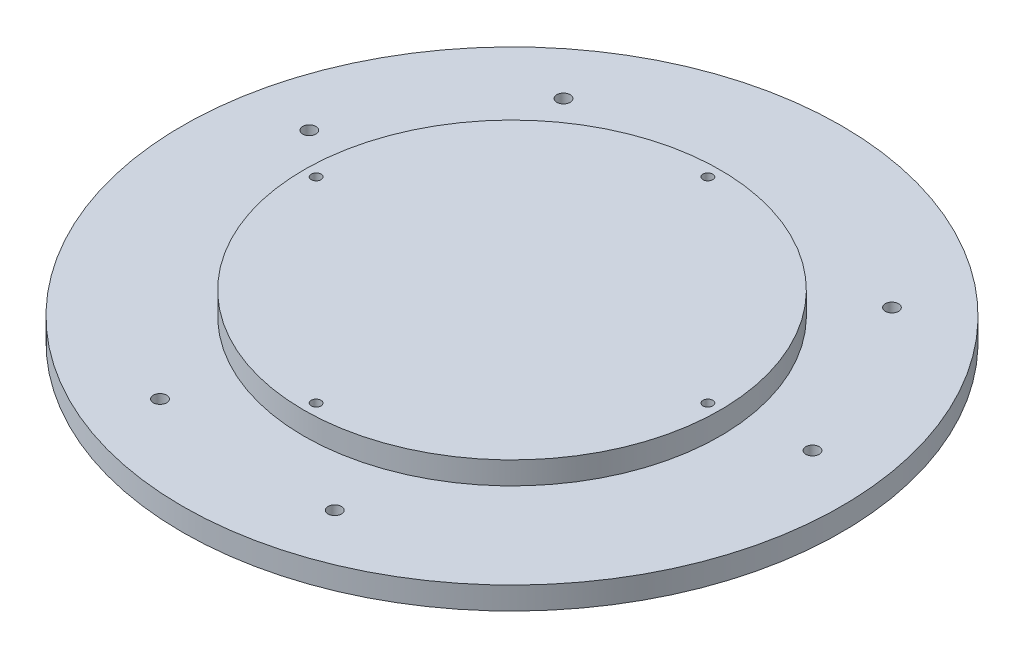
ISO-10303-21;
HEADER;
FILE_DESCRIPTION(('STEP AP214'),'2;1');
FILE_NAME('part.step','',(''),(''),'','','');
FILE_SCHEMA(('AUTOMOTIVE_DESIGN { 1 0 10303 214 1 1 1 1 }'));
ENDSEC;
DATA;
#1=APPLICATION_CONTEXT('core data for automotive mechanical design processes');
#2=APPLICATION_PROTOCOL_DEFINITION('international standard','automotive_design',2000,#1);
#3=PRODUCT_CONTEXT('',#1,'mechanical');
#4=PRODUCT('Part','Part','',(#3));
#5=PRODUCT_RELATED_PRODUCT_CATEGORY('part','',(#4));
#6=PRODUCT_DEFINITION_FORMATION('','',#4);
#7=PRODUCT_DEFINITION_CONTEXT('part definition',#1,'design');
#8=PRODUCT_DEFINITION('design','',#6,#7);
#9=PRODUCT_DEFINITION_SHAPE('','',#8);
#10=(LENGTH_UNIT() NAMED_UNIT(*) SI_UNIT(.MILLI.,.METRE.));
#11=(NAMED_UNIT(*) PLANE_ANGLE_UNIT() SI_UNIT($,.RADIAN.));
#12=(NAMED_UNIT(*) SI_UNIT($,.STERADIAN.) SOLID_ANGLE_UNIT());
#13=UNCERTAINTY_MEASURE_WITH_UNIT(LENGTH_MEASURE(1.E-05),#10,'distance_accuracy_value','');
#14=(GEOMETRIC_REPRESENTATION_CONTEXT(3) GLOBAL_UNCERTAINTY_ASSIGNED_CONTEXT((#13)) GLOBAL_UNIT_ASSIGNED_CONTEXT((#10,
#11,#12)) REPRESENTATION_CONTEXT('',''));
#15=CARTESIAN_POINT('',(0.,0.,0.));
#16=DIRECTION('',(0.,0.,1.));
#17=DIRECTION('',(1.,0.,0.));
#18=AXIS2_PLACEMENT_3D('',#15,#16,#17);
#19=CARTESIAN_POINT('',(0.,0.,0.));
#20=DIRECTION('',(0.,1.,0.));
#21=DIRECTION('',(0.,0.,1.));
#22=AXIS2_PLACEMENT_3D('',#19,#20,#21);
#23=PLANE('',#22);
#24=CARTESIAN_POINT('',(-26.5825681273002,0.,63.2682056914114));
#25=DIRECTION('',(0.,1.,0.));
#26=DIRECTION('',(0.,0.,1.));
#27=AXIS2_PLACEMENT_3D('',#24,#25,#26);
#28=CIRCLE('',#27,1.70000000000001);
#29=CARTESIAN_POINT('',(-26.5825681273002,0.,64.9682056914114));
#30=VERTEX_POINT('',#29);
#31=EDGE_CURVE('E36',#30,#30,#28,.T.);
#32=ORIENTED_EDGE('',*,*,#31,.F.);
#33=EDGE_LOOP('',(#32));
#34=FACE_BOUND('',#33,.T.);
#35=CARTESIAN_POINT('',(20.3045901077888,0.,65.5532028218911));
#36=DIRECTION('',(0.,1.,0.));
#37=DIRECTION('',(0.,0.,1.));
#38=AXIS2_PLACEMENT_3D('',#35,#36,#37);
#39=CIRCLE('',#38,1.70000000000001);
#40=CARTESIAN_POINT('',(20.3045901077888,0.,67.2532028218911));
#41=VERTEX_POINT('',#40);
#42=EDGE_CURVE('E79',#41,#41,#39,.T.);
#43=ORIENTED_EDGE('',*,*,#42,.F.);
#44=EDGE_LOOP('',(#43));
#45=FACE_BOUND('',#44,.T.);
#46=CARTESIAN_POINT('',(68.0831574442715,0.,-8.61292354963324));
#47=DIRECTION('',(0.,1.,0.));
#48=DIRECTION('',(0.,0.,1.));
#49=AXIS2_PLACEMENT_3D('',#46,#47,#48);
#50=CIRCLE('',#49,1.70000000000001);
#51=CARTESIAN_POINT('',(68.0831574442715,0.,-6.91292354963323));
#52=VERTEX_POINT('',#51);
#53=EDGE_CURVE('E75',#52,#52,#50,.T.);
#54=ORIENTED_EDGE('',*,*,#53,.F.);
#55=EDGE_LOOP('',(#54));
#56=FACE_BOUND('',#55,.T.);
#57=CARTESIAN_POINT('',(46.618443889297,0.,-50.3608922577209));
#58=DIRECTION('',(0.,1.,0.));
#59=DIRECTION('',(0.,0.,1.));
#60=AXIS2_PLACEMENT_3D('',#57,#58,#59);
#61=CIRCLE('',#60,1.70000000000001);
#62=CARTESIAN_POINT('',(46.618443889297,0.,-48.6608922577209));
#63=VERTEX_POINT('',#62);
#64=EDGE_CURVE('E70',#63,#63,#61,.T.);
#65=ORIENTED_EDGE('',*,*,#64,.F.);
#66=EDGE_LOOP('',(#65));
#67=FACE_BOUND('',#66,.T.);
#68=CARTESIAN_POINT('',(-41.5005893169714,0.,-54.6552821417781));
#69=DIRECTION('',(0.,1.,0.));
#70=DIRECTION('',(0.,0.,1.));
#71=AXIS2_PLACEMENT_3D('',#68,#69,#70);
#72=CIRCLE('',#71,1.70000000000001);
#73=CARTESIAN_POINT('',(-41.5005893169714,0.,-52.9552821417781));
#74=VERTEX_POINT('',#73);
#75=EDGE_CURVE('E65',#74,#74,#72,.T.);
#76=ORIENTED_EDGE('',*,*,#75,.F.);
#77=EDGE_LOOP('',(#76));
#78=FACE_BOUND('',#77,.T.);
#79=CARTESIAN_POINT('',(-66.9230339970858,0.,-15.1923105641702));
#80=DIRECTION('',(0.,1.,0.));
#81=DIRECTION('',(0.,0.,1.));
#82=AXIS2_PLACEMENT_3D('',#79,#80,#81);
#83=CIRCLE('',#82,1.70000000000001);
#84=CARTESIAN_POINT('',(-66.9230339970858,0.,-13.4923105641702));
#85=VERTEX_POINT('',#84);
#86=EDGE_CURVE('E61',#85,#85,#83,.T.);
#87=ORIENTED_EDGE('',*,*,#86,.F.);
#88=EDGE_LOOP('',(#87));
#89=FACE_BOUND('',#88,.T.);
#90=CARTESIAN_POINT('',(0.,0.,0.));
#91=DIRECTION('',(0.,1.,0.));
#92=DIRECTION('',(0.,0.,1.));
#93=AXIS2_PLACEMENT_3D('',#90,#91,#92);
#94=CIRCLE('',#93,84.1225);
#95=CARTESIAN_POINT('',(0.,0.,84.1225));
#96=VERTEX_POINT('',#95);
#97=EDGE_CURVE('E40',#96,#96,#94,.T.);
#98=ORIENTED_EDGE('',*,*,#97,.T.);
#99=EDGE_LOOP('',(#98));
#100=FACE_BOUND('',#99,.T.);
#101=CARTESIAN_POINT('',(0.,0.,0.));
#102=DIRECTION('',(0.,1.,0.));
#103=DIRECTION('',(0.,0.,1.));
#104=AXIS2_PLACEMENT_3D('',#101,#102,#103);
#105=CIRCLE('',#104,53.13);
#106=CARTESIAN_POINT('',(0.,0.,53.13));
#107=VERTEX_POINT('',#106);
#108=EDGE_CURVE('E48',#107,#107,#105,.T.);
#109=ORIENTED_EDGE('',*,*,#108,.F.);
#110=EDGE_LOOP('',(#109));
#111=FACE_BOUND('',#110,.T.);
#112=ADVANCED_FACE('F32',(#34,#45,#56,#67,#78,#89,#100,#111),#23,.T.);
#113=CARTESIAN_POINT('',(0.,-5.75,0.));
#114=DIRECTION('',(0.,1.,0.));
#115=DIRECTION('',(0.,0.,1.));
#116=AXIS2_PLACEMENT_3D('',#113,#114,#115);
#117=CYLINDRICAL_SURFACE('',#116,84.1225);
#118=CARTESIAN_POINT('',(0.,-5.75,0.));
#119=DIRECTION('',(0.,1.,0.));
#120=DIRECTION('',(0.,0.,1.));
#121=AXIS2_PLACEMENT_3D('',#118,#119,#120);
#122=CIRCLE('',#121,84.1225);
#123=CARTESIAN_POINT('',(0.,-5.75,84.1225));
#124=VERTEX_POINT('',#123);
#125=EDGE_CURVE('E10',#124,#124,#122,.T.);
#126=ORIENTED_EDGE('',*,*,#125,.T.);
#127=EDGE_LOOP('',(#126));
#128=FACE_BOUND('',#127,.T.);
#129=ORIENTED_EDGE('',*,*,#97,.F.);
#130=EDGE_LOOP('',(#129));
#131=FACE_BOUND('',#130,.T.);
#132=ADVANCED_FACE('F34',(#128,#131),#117,.T.);
#133=CARTESIAN_POINT('',(0.,-5.75,0.));
#134=DIRECTION('',(0.,1.,0.));
#135=DIRECTION('',(0.,0.,1.));
#136=AXIS2_PLACEMENT_3D('',#133,#134,#135);
#137=PLANE('',#136);
#138=CARTESIAN_POINT('',(-26.5825681273002,-5.75,63.2682056914114));
#139=DIRECTION('',(0.,-1.,0.));
#140=DIRECTION('',(0.,0.,-1.));
#141=AXIS2_PLACEMENT_3D('',#138,#139,#140);
#142=CIRCLE('',#141,4.7005);
#143=CARTESIAN_POINT('',(-26.5825681273002,-5.75,58.5677056914114));
#144=VERTEX_POINT('',#143);
#145=EDGE_CURVE('E293',#144,#144,#142,.T.);
#146=ORIENTED_EDGE('',*,*,#145,.F.);
#147=EDGE_LOOP('',(#146));
#148=FACE_BOUND('',#147,.T.);
#149=CARTESIAN_POINT('',(20.3045901077888,-5.75,65.5532028218911));
#150=DIRECTION('',(0.,-1.,0.));
#151=DIRECTION('',(0.,0.,-1.));
#152=AXIS2_PLACEMENT_3D('',#149,#150,#151);
#153=CIRCLE('',#152,4.7005);
#154=CARTESIAN_POINT('',(20.3045901077888,-5.75,60.8527028218911));
#155=VERTEX_POINT('',#154);
#156=EDGE_CURVE('E303',#155,#155,#153,.T.);
#157=ORIENTED_EDGE('',*,*,#156,.F.);
#158=EDGE_LOOP('',(#157));
#159=FACE_BOUND('',#158,.T.);
#160=CARTESIAN_POINT('',(68.0831574442715,-5.75,-8.61292354963324));
#161=DIRECTION('',(0.,-1.,0.));
#162=DIRECTION('',(0.,0.,-1.));
#163=AXIS2_PLACEMENT_3D('',#160,#161,#162);
#164=CIRCLE('',#163,4.7005);
#165=CARTESIAN_POINT('',(68.0831574442715,-5.75,-13.3134235496332));
#166=VERTEX_POINT('',#165);
#167=EDGE_CURVE('E81',#166,#166,#164,.T.);
#168=ORIENTED_EDGE('',*,*,#167,.F.);
#169=EDGE_LOOP('',(#168));
#170=FACE_BOUND('',#169,.T.);
#171=CARTESIAN_POINT('',(46.618443889297,-5.75,-50.3608922577209));
#172=DIRECTION('',(0.,-1.,0.));
#173=DIRECTION('',(0.,0.,-1.));
#174=AXIS2_PLACEMENT_3D('',#171,#172,#173);
#175=CIRCLE('',#174,4.7005);
#176=CARTESIAN_POINT('',(46.618443889297,-5.75,-55.0613922577209));
#177=VERTEX_POINT('',#176);
#178=EDGE_CURVE('E77',#177,#177,#175,.T.);
#179=ORIENTED_EDGE('',*,*,#178,.F.);
#180=EDGE_LOOP('',(#179));
#181=FACE_BOUND('',#180,.T.);
#182=CARTESIAN_POINT('',(-41.5005893169714,-5.75,-54.6552821417781));
#183=DIRECTION('',(0.,-1.,0.));
#184=DIRECTION('',(0.,0.,-1.));
#185=AXIS2_PLACEMENT_3D('',#182,#183,#184);
#186=CIRCLE('',#185,4.7005);
#187=CARTESIAN_POINT('',(-41.5005893169714,-5.75,-59.3557821417781));
#188=VERTEX_POINT('',#187);
#189=EDGE_CURVE('E73',#188,#188,#186,.T.);
#190=ORIENTED_EDGE('',*,*,#189,.F.);
#191=EDGE_LOOP('',(#190));
#192=FACE_BOUND('',#191,.T.);
#193=CARTESIAN_POINT('',(-66.9230339970858,-5.75,-15.1923105641702));
#194=DIRECTION('',(0.,-1.,0.));
#195=DIRECTION('',(0.,0.,-1.));
#196=AXIS2_PLACEMENT_3D('',#193,#194,#195);
#197=CIRCLE('',#196,4.7005);
#198=CARTESIAN_POINT('',(-66.9230339970858,-5.75,-19.8928105641702));
#199=VERTEX_POINT('',#198);
#200=EDGE_CURVE('E68',#199,#199,#197,.T.);
#201=ORIENTED_EDGE('',*,*,#200,.F.);
#202=EDGE_LOOP('',(#201));
#203=FACE_BOUND('',#202,.T.);
#204=CARTESIAN_POINT('',(0.,-5.75,-50.));
#205=DIRECTION('',(0.,-1.,0.));
#206=DIRECTION('',(0.,0.,-1.));
#207=AXIS2_PLACEMENT_3D('',#204,#205,#206);
#208=CIRCLE('',#207,1.24999999999999);
#209=CARTESIAN_POINT('',(0.,-5.75,-51.25));
#210=VERTEX_POINT('',#209);
#211=EDGE_CURVE('E60',#210,#210,#208,.T.);
#212=ORIENTED_EDGE('',*,*,#211,.F.);
#213=EDGE_LOOP('',(#212));
#214=FACE_BOUND('',#213,.T.);
#215=CARTESIAN_POINT('',(-50.,-5.75,0.));
#216=DIRECTION('',(0.,-1.,0.));
#217=DIRECTION('',(0.,0.,-1.));
#218=AXIS2_PLACEMENT_3D('',#215,#216,#217);
#219=CIRCLE('',#218,1.24999999999999);
#220=CARTESIAN_POINT('',(-50.,-5.75,-1.24999999999999));
#221=VERTEX_POINT('',#220);
#222=EDGE_CURVE('E59',#221,#221,#219,.T.);
#223=ORIENTED_EDGE('',*,*,#222,.F.);
#224=EDGE_LOOP('',(#223));
#225=FACE_BOUND('',#224,.T.);
#226=CARTESIAN_POINT('',(0.,-5.75,50.));
#227=DIRECTION('',(0.,-1.,0.));
#228=DIRECTION('',(0.,0.,-1.));
#229=AXIS2_PLACEMENT_3D('',#226,#227,#228);
#230=CIRCLE('',#229,1.24999999999999);
#231=CARTESIAN_POINT('',(0.,-5.75,48.75));
#232=VERTEX_POINT('',#231);
#233=EDGE_CURVE('E55',#232,#232,#230,.T.);
#234=ORIENTED_EDGE('',*,*,#233,.F.);
#235=EDGE_LOOP('',(#234));
#236=FACE_BOUND('',#235,.T.);
#237=CARTESIAN_POINT('',(50.,-5.75,0.));
#238=DIRECTION('',(0.,-1.,0.));
#239=DIRECTION('',(0.,0.,-1.));
#240=AXIS2_PLACEMENT_3D('',#237,#238,#239);
#241=CIRCLE('',#240,1.24999999999999);
#242=CARTESIAN_POINT('',(50.,-5.75,-1.24999999999999));
#243=VERTEX_POINT('',#242);
#244=EDGE_CURVE('E54',#243,#243,#241,.T.);
#245=ORIENTED_EDGE('',*,*,#244,.F.);
#246=EDGE_LOOP('',(#245));
#247=FACE_BOUND('',#246,.T.);
#248=ORIENTED_EDGE('',*,*,#125,.F.);
#249=EDGE_LOOP('',(#248));
#250=FACE_BOUND('',#249,.T.);
#251=ADVANCED_FACE('F161',(#148,#159,#170,#181,#192,#203,#214,#225,#236,#247,#250),#137,.F.);
#252=CARTESIAN_POINT('',(0.,5.75,0.));
#253=DIRECTION('',(0.,-1.,0.));
#254=DIRECTION('',(0.,0.,-1.));
#255=AXIS2_PLACEMENT_3D('',#252,#253,#254);
#256=CYLINDRICAL_SURFACE('',#255,53.13);
#257=CARTESIAN_POINT('',(0.,5.75,0.));
#258=DIRECTION('',(0.,1.,0.));
#259=DIRECTION('',(0.,0.,1.));
#260=AXIS2_PLACEMENT_3D('',#257,#258,#259);
#261=CIRCLE('',#260,53.13);
#262=CARTESIAN_POINT('',(0.,5.75,53.13));
#263=VERTEX_POINT('',#262);
#264=EDGE_CURVE('E45',#263,#263,#261,.T.);
#265=ORIENTED_EDGE('',*,*,#264,.F.);
#266=EDGE_LOOP('',(#265));
#267=FACE_BOUND('',#266,.T.);
#268=ORIENTED_EDGE('',*,*,#108,.T.);
#269=EDGE_LOOP('',(#268));
#270=FACE_BOUND('',#269,.T.);
#271=ADVANCED_FACE('F154',(#267,#270),#256,.T.);
#272=CARTESIAN_POINT('',(0.,5.75,0.));
#273=DIRECTION('',(0.,1.,0.));
#274=DIRECTION('',(0.,0.,1.));
#275=AXIS2_PLACEMENT_3D('',#272,#273,#274);
#276=PLANE('',#275);
#277=CARTESIAN_POINT('',(0.,5.75,-50.));
#278=DIRECTION('',(0.,1.,0.));
#279=DIRECTION('',(0.,0.,1.));
#280=AXIS2_PLACEMENT_3D('',#277,#278,#279);
#281=CIRCLE('',#280,1.24999999999999);
#282=CARTESIAN_POINT('',(0.,5.75,-48.75));
#283=VERTEX_POINT('',#282);
#284=EDGE_CURVE('E56',#283,#283,#281,.T.);
#285=ORIENTED_EDGE('',*,*,#284,.F.);
#286=EDGE_LOOP('',(#285));
#287=FACE_BOUND('',#286,.T.);
#288=CARTESIAN_POINT('',(-50.,5.75,0.));
#289=DIRECTION('',(0.,1.,0.));
#290=DIRECTION('',(0.,0.,1.));
#291=AXIS2_PLACEMENT_3D('',#288,#289,#290);
#292=CIRCLE('',#291,1.24999999999999);
#293=CARTESIAN_POINT('',(-50.,5.75,1.24999999999999));
#294=VERTEX_POINT('',#293);
#295=EDGE_CURVE('E139',#294,#294,#292,.T.);
#296=ORIENTED_EDGE('',*,*,#295,.F.);
#297=EDGE_LOOP('',(#296));
#298=FACE_BOUND('',#297,.T.);
#299=CARTESIAN_POINT('',(0.,5.75,50.));
#300=DIRECTION('',(0.,1.,0.));
#301=DIRECTION('',(0.,0.,1.));
#302=AXIS2_PLACEMENT_3D('',#299,#300,#301);
#303=CIRCLE('',#302,1.24999999999999);
#304=CARTESIAN_POINT('',(0.,5.75,51.25));
#305=VERTEX_POINT('',#304);
#306=EDGE_CURVE('E51',#305,#305,#303,.T.);
#307=ORIENTED_EDGE('',*,*,#306,.F.);
#308=EDGE_LOOP('',(#307));
#309=FACE_BOUND('',#308,.T.);
#310=CARTESIAN_POINT('',(50.,5.75,0.));
#311=DIRECTION('',(0.,1.,0.));
#312=DIRECTION('',(0.,0.,1.));
#313=AXIS2_PLACEMENT_3D('',#310,#311,#312);
#314=CIRCLE('',#313,1.24999999999999);
#315=CARTESIAN_POINT('',(50.,5.75,1.24999999999999));
#316=VERTEX_POINT('',#315);
#317=EDGE_CURVE('E146',#316,#316,#314,.T.);
#318=ORIENTED_EDGE('',*,*,#317,.F.);
#319=EDGE_LOOP('',(#318));
#320=FACE_BOUND('',#319,.T.);
#321=ORIENTED_EDGE('',*,*,#264,.T.);
#322=EDGE_LOOP('',(#321));
#323=FACE_BOUND('',#322,.T.);
#324=ADVANCED_FACE('F170',(#287,#298,#309,#320,#323),#276,.T.);
#325=CARTESIAN_POINT('',(50.,-5.75,0.));
#326=DIRECTION('',(0.,-1.,0.));
#327=DIRECTION('',(0.,0.,-1.));
#328=AXIS2_PLACEMENT_3D('',#325,#326,#327);
#329=CYLINDRICAL_SURFACE('',#328,1.24999999999999);
#330=ORIENTED_EDGE('',*,*,#317,.T.);
#331=EDGE_LOOP('',(#330));
#332=FACE_BOUND('',#331,.T.);
#333=ORIENTED_EDGE('',*,*,#244,.T.);
#334=EDGE_LOOP('',(#333));
#335=FACE_BOUND('',#334,.T.);
#336=ADVANCED_FACE('F174',(#332,#335),#329,.F.);
#337=CARTESIAN_POINT('',(0.,-5.75,50.));
#338=DIRECTION('',(0.,-1.,0.));
#339=DIRECTION('',(0.,0.,-1.));
#340=AXIS2_PLACEMENT_3D('',#337,#338,#339);
#341=CYLINDRICAL_SURFACE('',#340,1.24999999999999);
#342=ORIENTED_EDGE('',*,*,#306,.T.);
#343=EDGE_LOOP('',(#342));
#344=FACE_BOUND('',#343,.T.);
#345=ORIENTED_EDGE('',*,*,#233,.T.);
#346=EDGE_LOOP('',(#345));
#347=FACE_BOUND('',#346,.T.);
#348=ADVANCED_FACE('F178',(#344,#347),#341,.F.);
#349=CARTESIAN_POINT('',(-50.,-5.75,0.));
#350=DIRECTION('',(0.,-1.,0.));
#351=DIRECTION('',(0.,0.,-1.));
#352=AXIS2_PLACEMENT_3D('',#349,#350,#351);
#353=CYLINDRICAL_SURFACE('',#352,1.24999999999999);
#354=ORIENTED_EDGE('',*,*,#295,.T.);
#355=EDGE_LOOP('',(#354));
#356=FACE_BOUND('',#355,.T.);
#357=ORIENTED_EDGE('',*,*,#222,.T.);
#358=EDGE_LOOP('',(#357));
#359=FACE_BOUND('',#358,.T.);
#360=ADVANCED_FACE('F182',(#356,#359),#353,.F.);
#361=CARTESIAN_POINT('',(0.,-5.75,-50.));
#362=DIRECTION('',(0.,-1.,0.));
#363=DIRECTION('',(0.,0.,-1.));
#364=AXIS2_PLACEMENT_3D('',#361,#362,#363);
#365=CYLINDRICAL_SURFACE('',#364,1.24999999999999);
#366=ORIENTED_EDGE('',*,*,#284,.T.);
#367=EDGE_LOOP('',(#366));
#368=FACE_BOUND('',#367,.T.);
#369=ORIENTED_EDGE('',*,*,#211,.T.);
#370=EDGE_LOOP('',(#369));
#371=FACE_BOUND('',#370,.T.);
#372=ADVANCED_FACE('F186',(#368,#371),#365,.F.);
#373=CARTESIAN_POINT('',(-66.9230339970858,-5.75,-15.1923105641702));
#374=DIRECTION('',(0.,-1.,0.));
#375=DIRECTION('',(0.,0.,-1.));
#376=AXIS2_PLACEMENT_3D('',#373,#374,#375);
#377=CYLINDRICAL_SURFACE('',#376,1.70000000000001);
#378=ORIENTED_EDGE('',*,*,#86,.T.);
#379=EDGE_LOOP('',(#378));
#380=FACE_BOUND('',#379,.T.);
#381=CARTESIAN_POINT('',(-66.9230339970858,-3.75,-15.1923105641702));
#382=DIRECTION('',(0.,-1.,0.));
#383=DIRECTION('',(0.,0.,-1.));
#384=AXIS2_PLACEMENT_3D('',#381,#382,#383);
#385=CIRCLE('',#384,1.70000000000001);
#386=CARTESIAN_POINT('',(-66.9230339970858,-3.75,-16.8923105641702));
#387=VERTEX_POINT('',#386);
#388=EDGE_CURVE('E64',#387,#387,#385,.T.);
#389=ORIENTED_EDGE('',*,*,#388,.T.);
#390=EDGE_LOOP('',(#389));
#391=FACE_BOUND('',#390,.T.);
#392=ADVANCED_FACE('F190',(#380,#391),#377,.F.);
#393=CARTESIAN_POINT('',(-62.2475339970858,-3.75,-15.1923105641702));
#394=DIRECTION('',(0.,1.,0.));
#395=DIRECTION('',(0.,0.,1.));
#396=AXIS2_PLACEMENT_3D('',#393,#394,#395);
#397=PLANE('',#396);
#398=ORIENTED_EDGE('',*,*,#388,.F.);
#399=EDGE_LOOP('',(#398));
#400=FACE_BOUND('',#399,.T.);
#401=CARTESIAN_POINT('',(-66.9230339970858,-3.75,-15.1923105641702));
#402=DIRECTION('',(0.,-1.,0.));
#403=DIRECTION('',(0.,0.,-1.));
#404=AXIS2_PLACEMENT_3D('',#401,#402,#403);
#405=CIRCLE('',#404,4.6755);
#406=CARTESIAN_POINT('',(-66.9230339970858,-3.75,-19.8678105641702));
#407=VERTEX_POINT('',#406);
#408=EDGE_CURVE('E130',#407,#407,#405,.T.);
#409=ORIENTED_EDGE('',*,*,#408,.T.);
#410=EDGE_LOOP('',(#409));
#411=FACE_BOUND('',#410,.T.);
#412=ADVANCED_FACE('F194',(#400,#411),#397,.F.);
#413=CARTESIAN_POINT('',(-66.9230339970858,-5.75,-15.1923105641702));
#414=DIRECTION('',(0.,-1.,0.));
#415=DIRECTION('',(0.,0.,-1.));
#416=AXIS2_PLACEMENT_3D('',#413,#414,#415);
#417=CYLINDRICAL_SURFACE('',#416,4.6755);
#418=ORIENTED_EDGE('',*,*,#408,.F.);
#419=EDGE_LOOP('',(#418));
#420=FACE_BOUND('',#419,.T.);
#421=CARTESIAN_POINT('',(-66.9230339970858,-5.725,-15.1923105641702));
#422=DIRECTION('',(0.,-1.,0.));
#423=DIRECTION('',(0.,0.,-1.));
#424=AXIS2_PLACEMENT_3D('',#421,#422,#423);
#425=CIRCLE('',#424,4.6755);
#426=CARTESIAN_POINT('',(-66.9230339970858,-5.725,-19.8678105641702));
#427=VERTEX_POINT('',#426);
#428=EDGE_CURVE('E127',#427,#427,#425,.T.);
#429=ORIENTED_EDGE('',*,*,#428,.T.);
#430=EDGE_LOOP('',(#429));
#431=FACE_BOUND('',#430,.T.);
#432=ADVANCED_FACE('F198',(#420,#431),#417,.F.);
#433=CARTESIAN_POINT('',(-66.9230339970858,-5.75,-15.1923105641702));
#434=DIRECTION('',(0.,-1.,0.));
#435=DIRECTION('',(0.,0.,-1.));
#436=AXIS2_PLACEMENT_3D('',#433,#434,#435);
#437=CONICAL_SURFACE('',#436,4.7005,0.785398163397379);
#438=ORIENTED_EDGE('',*,*,#428,.F.);
#439=EDGE_LOOP('',(#438));
#440=FACE_BOUND('',#439,.T.);
#441=ORIENTED_EDGE('',*,*,#200,.T.);
#442=EDGE_LOOP('',(#441));
#443=FACE_BOUND('',#442,.T.);
#444=ADVANCED_FACE('F202',(#440,#443),#437,.F.);
#445=CARTESIAN_POINT('',(-41.5005893169714,-5.75,-54.6552821417781));
#446=DIRECTION('',(0.,-1.,0.));
#447=DIRECTION('',(0.,0.,-1.));
#448=AXIS2_PLACEMENT_3D('',#445,#446,#447);
#449=CYLINDRICAL_SURFACE('',#448,1.70000000000001);
#450=ORIENTED_EDGE('',*,*,#75,.T.);
#451=EDGE_LOOP('',(#450));
#452=FACE_BOUND('',#451,.T.);
#453=CARTESIAN_POINT('',(-41.5005893169714,-3.75,-54.6552821417781));
#454=DIRECTION('',(0.,-1.,0.));
#455=DIRECTION('',(0.,0.,-1.));
#456=AXIS2_PLACEMENT_3D('',#453,#454,#455);
#457=CIRCLE('',#456,1.70000000000001);
#458=CARTESIAN_POINT('',(-41.5005893169714,-3.75,-56.3552821417782));
#459=VERTEX_POINT('',#458);
#460=EDGE_CURVE('E69',#459,#459,#457,.T.);
#461=ORIENTED_EDGE('',*,*,#460,.T.);
#462=EDGE_LOOP('',(#461));
#463=FACE_BOUND('',#462,.T.);
#464=ADVANCED_FACE('F206',(#452,#463),#449,.F.);
#465=CARTESIAN_POINT('',(-36.8250893169714,-3.75,-54.6552821417781));
#466=DIRECTION('',(0.,1.,0.));
#467=DIRECTION('',(0.,0.,1.));
#468=AXIS2_PLACEMENT_3D('',#465,#466,#467);
#469=PLANE('',#468);
#470=ORIENTED_EDGE('',*,*,#460,.F.);
#471=EDGE_LOOP('',(#470));
#472=FACE_BOUND('',#471,.T.);
#473=CARTESIAN_POINT('',(-41.5005893169714,-3.75,-54.6552821417781));
#474=DIRECTION('',(0.,-1.,0.));
#475=DIRECTION('',(0.,0.,-1.));
#476=AXIS2_PLACEMENT_3D('',#473,#474,#475);
#477=CIRCLE('',#476,4.6755);
#478=CARTESIAN_POINT('',(-41.5005893169714,-3.75,-59.3307821417781));
#479=VERTEX_POINT('',#478);
#480=EDGE_CURVE('E120',#479,#479,#477,.T.);
#481=ORIENTED_EDGE('',*,*,#480,.T.);
#482=EDGE_LOOP('',(#481));
#483=FACE_BOUND('',#482,.T.);
#484=ADVANCED_FACE('F210',(#472,#483),#469,.F.);
#485=CARTESIAN_POINT('',(-41.5005893169714,-5.75,-54.6552821417781));
#486=DIRECTION('',(0.,-1.,0.));
#487=DIRECTION('',(0.,0.,-1.));
#488=AXIS2_PLACEMENT_3D('',#485,#486,#487);
#489=CYLINDRICAL_SURFACE('',#488,4.6755);
#490=ORIENTED_EDGE('',*,*,#480,.F.);
#491=EDGE_LOOP('',(#490));
#492=FACE_BOUND('',#491,.T.);
#493=CARTESIAN_POINT('',(-41.5005893169714,-5.725,-54.6552821417781));
#494=DIRECTION('',(0.,-1.,0.));
#495=DIRECTION('',(0.,0.,-1.));
#496=AXIS2_PLACEMENT_3D('',#493,#494,#495);
#497=CIRCLE('',#496,4.6755);
#498=CARTESIAN_POINT('',(-41.5005893169714,-5.725,-59.3307821417781));
#499=VERTEX_POINT('',#498);
#500=EDGE_CURVE('E117',#499,#499,#497,.T.);
#501=ORIENTED_EDGE('',*,*,#500,.T.);
#502=EDGE_LOOP('',(#501));
#503=FACE_BOUND('',#502,.T.);
#504=ADVANCED_FACE('F214',(#492,#503),#489,.F.);
#505=CARTESIAN_POINT('',(-41.5005893169714,-5.75,-54.6552821417781));
#506=DIRECTION('',(0.,-1.,0.));
#507=DIRECTION('',(0.,0.,-1.));
#508=AXIS2_PLACEMENT_3D('',#505,#506,#507);
#509=CONICAL_SURFACE('',#508,4.7005,0.785398163397518);
#510=ORIENTED_EDGE('',*,*,#500,.F.);
#511=EDGE_LOOP('',(#510));
#512=FACE_BOUND('',#511,.T.);
#513=ORIENTED_EDGE('',*,*,#189,.T.);
#514=EDGE_LOOP('',(#513));
#515=FACE_BOUND('',#514,.T.);
#516=ADVANCED_FACE('F218',(#512,#515),#509,.F.);
#517=CARTESIAN_POINT('',(46.618443889297,-5.75,-50.3608922577209));
#518=DIRECTION('',(0.,-1.,0.));
#519=DIRECTION('',(0.,0.,-1.));
#520=AXIS2_PLACEMENT_3D('',#517,#518,#519);
#521=CYLINDRICAL_SURFACE('',#520,1.70000000000001);
#522=ORIENTED_EDGE('',*,*,#64,.T.);
#523=EDGE_LOOP('',(#522));
#524=FACE_BOUND('',#523,.T.);
#525=CARTESIAN_POINT('',(46.618443889297,-3.75,-50.3608922577209));
#526=DIRECTION('',(0.,-1.,0.));
#527=DIRECTION('',(0.,0.,-1.));
#528=AXIS2_PLACEMENT_3D('',#525,#526,#527);
#529=CIRCLE('',#528,1.70000000000001);
#530=CARTESIAN_POINT('',(46.618443889297,-3.75,-52.0608922577209));
#531=VERTEX_POINT('',#530);
#532=EDGE_CURVE('E74',#531,#531,#529,.T.);
#533=ORIENTED_EDGE('',*,*,#532,.T.);
#534=EDGE_LOOP('',(#533));
#535=FACE_BOUND('',#534,.T.);
#536=ADVANCED_FACE('F222',(#524,#535),#521,.F.);
#537=CARTESIAN_POINT('',(51.293943889297,-3.75,-50.3608922577209));
#538=DIRECTION('',(0.,1.,0.));
#539=DIRECTION('',(0.,0.,1.));
#540=AXIS2_PLACEMENT_3D('',#537,#538,#539);
#541=PLANE('',#540);
#542=ORIENTED_EDGE('',*,*,#532,.F.);
#543=EDGE_LOOP('',(#542));
#544=FACE_BOUND('',#543,.T.);
#545=CARTESIAN_POINT('',(46.618443889297,-3.75,-50.3608922577209));
#546=DIRECTION('',(0.,-1.,0.));
#547=DIRECTION('',(0.,0.,-1.));
#548=AXIS2_PLACEMENT_3D('',#545,#546,#547);
#549=CIRCLE('',#548,4.6755);
#550=CARTESIAN_POINT('',(46.618443889297,-3.75,-55.0363922577209));
#551=VERTEX_POINT('',#550);
#552=EDGE_CURVE('E110',#551,#551,#549,.T.);
#553=ORIENTED_EDGE('',*,*,#552,.T.);
#554=EDGE_LOOP('',(#553));
#555=FACE_BOUND('',#554,.T.);
#556=ADVANCED_FACE('F226',(#544,#555),#541,.F.);
#557=CARTESIAN_POINT('',(46.618443889297,-5.75,-50.3608922577209));
#558=DIRECTION('',(0.,-1.,0.));
#559=DIRECTION('',(0.,0.,-1.));
#560=AXIS2_PLACEMENT_3D('',#557,#558,#559);
#561=CYLINDRICAL_SURFACE('',#560,4.6755);
#562=ORIENTED_EDGE('',*,*,#552,.F.);
#563=EDGE_LOOP('',(#562));
#564=FACE_BOUND('',#563,.T.);
#565=CARTESIAN_POINT('',(46.618443889297,-5.725,-50.3608922577209));
#566=DIRECTION('',(0.,-1.,0.));
#567=DIRECTION('',(0.,0.,-1.));
#568=AXIS2_PLACEMENT_3D('',#565,#566,#567);
#569=CIRCLE('',#568,4.6755);
#570=CARTESIAN_POINT('',(46.618443889297,-5.725,-55.0363922577209));
#571=VERTEX_POINT('',#570);
#572=EDGE_CURVE('E107',#571,#571,#569,.T.);
#573=ORIENTED_EDGE('',*,*,#572,.T.);
#574=EDGE_LOOP('',(#573));
#575=FACE_BOUND('',#574,.T.);
#576=ADVANCED_FACE('F230',(#564,#575),#561,.F.);
#577=CARTESIAN_POINT('',(46.618443889297,-5.75,-50.3608922577209));
#578=DIRECTION('',(0.,-1.,0.));
#579=DIRECTION('',(0.,0.,-1.));
#580=AXIS2_PLACEMENT_3D('',#577,#578,#579);
#581=CONICAL_SURFACE('',#580,4.7005,0.785398163397379);
#582=ORIENTED_EDGE('',*,*,#572,.F.);
#583=EDGE_LOOP('',(#582));
#584=FACE_BOUND('',#583,.T.);
#585=ORIENTED_EDGE('',*,*,#178,.T.);
#586=EDGE_LOOP('',(#585));
#587=FACE_BOUND('',#586,.T.);
#588=ADVANCED_FACE('F234',(#584,#587),#581,.F.);
#589=CARTESIAN_POINT('',(68.0831574442715,-5.75,-8.61292354963324));
#590=DIRECTION('',(0.,-1.,0.));
#591=DIRECTION('',(0.,0.,-1.));
#592=AXIS2_PLACEMENT_3D('',#589,#590,#591);
#593=CYLINDRICAL_SURFACE('',#592,1.70000000000001);
#594=ORIENTED_EDGE('',*,*,#53,.T.);
#595=EDGE_LOOP('',(#594));
#596=FACE_BOUND('',#595,.T.);
#597=CARTESIAN_POINT('',(68.0831574442715,-3.75,-8.61292354963324));
#598=DIRECTION('',(0.,-1.,0.));
#599=DIRECTION('',(0.,0.,-1.));
#600=AXIS2_PLACEMENT_3D('',#597,#598,#599);
#601=CIRCLE('',#600,1.70000000000001);
#602=CARTESIAN_POINT('',(68.0831574442715,-3.75,-10.3129235496332));
#603=VERTEX_POINT('',#602);
#604=EDGE_CURVE('E78',#603,#603,#601,.T.);
#605=ORIENTED_EDGE('',*,*,#604,.T.);
#606=EDGE_LOOP('',(#605));
#607=FACE_BOUND('',#606,.T.);
#608=ADVANCED_FACE('F238',(#596,#607),#593,.F.);
#609=CARTESIAN_POINT('',(72.7586574442715,-3.75,-8.61292354963324));
#610=DIRECTION('',(0.,1.,0.));
#611=DIRECTION('',(0.,0.,1.));
#612=AXIS2_PLACEMENT_3D('',#609,#610,#611);
#613=PLANE('',#612);
#614=ORIENTED_EDGE('',*,*,#604,.F.);
#615=EDGE_LOOP('',(#614));
#616=FACE_BOUND('',#615,.T.);
#617=CARTESIAN_POINT('',(68.0831574442715,-3.75,-8.61292354963324));
#618=DIRECTION('',(0.,-1.,0.));
#619=DIRECTION('',(0.,0.,-1.));
#620=AXIS2_PLACEMENT_3D('',#617,#618,#619);
#621=CIRCLE('',#620,4.6755);
#622=CARTESIAN_POINT('',(68.0831574442715,-3.75,-13.2884235496332));
#623=VERTEX_POINT('',#622);
#624=EDGE_CURVE('E100',#623,#623,#621,.T.);
#625=ORIENTED_EDGE('',*,*,#624,.T.);
#626=EDGE_LOOP('',(#625));
#627=FACE_BOUND('',#626,.T.);
#628=ADVANCED_FACE('F242',(#616,#627),#613,.F.);
#629=CARTESIAN_POINT('',(68.0831574442715,-5.75,-8.61292354963324));
#630=DIRECTION('',(0.,-1.,0.));
#631=DIRECTION('',(0.,0.,-1.));
#632=AXIS2_PLACEMENT_3D('',#629,#630,#631);
#633=CYLINDRICAL_SURFACE('',#632,4.6755);
#634=ORIENTED_EDGE('',*,*,#624,.F.);
#635=EDGE_LOOP('',(#634));
#636=FACE_BOUND('',#635,.T.);
#637=CARTESIAN_POINT('',(68.0831574442715,-5.725,-8.61292354963324));
#638=DIRECTION('',(0.,-1.,0.));
#639=DIRECTION('',(0.,0.,-1.));
#640=AXIS2_PLACEMENT_3D('',#637,#638,#639);
#641=CIRCLE('',#640,4.6755);
#642=CARTESIAN_POINT('',(68.0831574442715,-5.725,-13.2884235496332));
#643=VERTEX_POINT('',#642);
#644=EDGE_CURVE('E86',#643,#643,#641,.T.);
#645=ORIENTED_EDGE('',*,*,#644,.T.);
#646=EDGE_LOOP('',(#645));
#647=FACE_BOUND('',#646,.T.);
#648=ADVANCED_FACE('F246',(#636,#647),#633,.F.);
#649=CARTESIAN_POINT('',(68.0831574442715,-5.75,-8.61292354963324));
#650=DIRECTION('',(0.,-1.,0.));
#651=DIRECTION('',(0.,0.,-1.));
#652=AXIS2_PLACEMENT_3D('',#649,#650,#651);
#653=CONICAL_SURFACE('',#652,4.7005,0.785398163397379);
#654=ORIENTED_EDGE('',*,*,#644,.F.);
#655=EDGE_LOOP('',(#654));
#656=FACE_BOUND('',#655,.T.);
#657=ORIENTED_EDGE('',*,*,#167,.T.);
#658=EDGE_LOOP('',(#657));
#659=FACE_BOUND('',#658,.T.);
#660=ADVANCED_FACE('F250',(#656,#659),#653,.F.);
#661=CARTESIAN_POINT('',(20.3045901077888,-5.75,65.5532028218911));
#662=DIRECTION('',(0.,-1.,0.));
#663=DIRECTION('',(0.,0.,-1.));
#664=AXIS2_PLACEMENT_3D('',#661,#662,#663);
#665=CYLINDRICAL_SURFACE('',#664,1.70000000000001);
#666=ORIENTED_EDGE('',*,*,#42,.T.);
#667=EDGE_LOOP('',(#666));
#668=FACE_BOUND('',#667,.T.);
#669=CARTESIAN_POINT('',(20.3045901077888,-3.75,65.5532028218911));
#670=DIRECTION('',(0.,-1.,0.));
#671=DIRECTION('',(0.,0.,-1.));
#672=AXIS2_PLACEMENT_3D('',#669,#670,#671);
#673=CIRCLE('',#672,1.70000000000001);
#674=CARTESIAN_POINT('',(20.3045901077888,-3.75,63.8532028218911));
#675=VERTEX_POINT('',#674);
#676=EDGE_CURVE('E82',#675,#675,#673,.T.);
#677=ORIENTED_EDGE('',*,*,#676,.T.);
#678=EDGE_LOOP('',(#677));
#679=FACE_BOUND('',#678,.T.);
#680=ADVANCED_FACE('F254',(#668,#679),#665,.F.);
#681=CARTESIAN_POINT('',(24.9800901077888,-3.75,65.5532028218911));
#682=DIRECTION('',(0.,1.,0.));
#683=DIRECTION('',(0.,0.,1.));
#684=AXIS2_PLACEMENT_3D('',#681,#682,#683);
#685=PLANE('',#684);
#686=ORIENTED_EDGE('',*,*,#676,.F.);
#687=EDGE_LOOP('',(#686));
#688=FACE_BOUND('',#687,.T.);
#689=CARTESIAN_POINT('',(20.3045901077888,-3.75,65.5532028218911));
#690=DIRECTION('',(0.,-1.,0.));
#691=DIRECTION('',(0.,0.,-1.));
#692=AXIS2_PLACEMENT_3D('',#689,#690,#691);
#693=CIRCLE('',#692,4.6755);
#694=CARTESIAN_POINT('',(20.3045901077888,-3.75,60.8777028218911));
#695=VERTEX_POINT('',#694);
#696=EDGE_CURVE('E89',#695,#695,#693,.T.);
#697=ORIENTED_EDGE('',*,*,#696,.T.);
#698=EDGE_LOOP('',(#697));
#699=FACE_BOUND('',#698,.T.);
#700=ADVANCED_FACE('F258',(#688,#699),#685,.F.);
#701=CARTESIAN_POINT('',(20.3045901077888,-5.75,65.5532028218911));
#702=DIRECTION('',(0.,-1.,0.));
#703=DIRECTION('',(0.,0.,-1.));
#704=AXIS2_PLACEMENT_3D('',#701,#702,#703);
#705=CYLINDRICAL_SURFACE('',#704,4.6755);
#706=ORIENTED_EDGE('',*,*,#696,.F.);
#707=EDGE_LOOP('',(#706));
#708=FACE_BOUND('',#707,.T.);
#709=CARTESIAN_POINT('',(20.3045901077888,-5.725,65.5532028218911));
#710=DIRECTION('',(0.,-1.,0.));
#711=DIRECTION('',(0.,0.,-1.));
#712=AXIS2_PLACEMENT_3D('',#709,#710,#711);
#713=CIRCLE('',#712,4.6755);
#714=CARTESIAN_POINT('',(20.3045901077888,-5.725,60.8777028218911));
#715=VERTEX_POINT('',#714);
#716=EDGE_CURVE('E94',#715,#715,#713,.T.);
#717=ORIENTED_EDGE('',*,*,#716,.T.);
#718=EDGE_LOOP('',(#717));
#719=FACE_BOUND('',#718,.T.);
#720=ADVANCED_FACE('F261',(#708,#719),#705,.F.);
#721=CARTESIAN_POINT('',(20.3045901077888,-5.75,65.5532028218911));
#722=DIRECTION('',(0.,-1.,0.));
#723=DIRECTION('',(0.,0.,-1.));
#724=AXIS2_PLACEMENT_3D('',#721,#722,#723);
#725=CONICAL_SURFACE('',#724,4.7005,0.785398163397448);
#726=ORIENTED_EDGE('',*,*,#716,.F.);
#727=EDGE_LOOP('',(#726));
#728=FACE_BOUND('',#727,.T.);
#729=ORIENTED_EDGE('',*,*,#156,.T.);
#730=EDGE_LOOP('',(#729));
#731=FACE_BOUND('',#730,.T.);
#732=ADVANCED_FACE('F265',(#728,#731),#725,.F.);
#733=CARTESIAN_POINT('',(-26.5825681273002,-5.75,63.2682056914114));
#734=DIRECTION('',(0.,-1.,0.));
#735=DIRECTION('',(0.,0.,-1.));
#736=AXIS2_PLACEMENT_3D('',#733,#734,#735);
#737=CYLINDRICAL_SURFACE('',#736,1.70000000000001);
#738=ORIENTED_EDGE('',*,*,#31,.T.);
#739=EDGE_LOOP('',(#738));
#740=FACE_BOUND('',#739,.T.);
#741=CARTESIAN_POINT('',(-26.5825681273002,-3.75,63.2682056914114));
#742=DIRECTION('',(0.,-1.,0.));
#743=DIRECTION('',(0.,0.,-1.));
#744=AXIS2_PLACEMENT_3D('',#741,#742,#743);
#745=CIRCLE('',#744,1.70000000000001);
#746=CARTESIAN_POINT('',(-26.5825681273002,-3.75,61.5682056914113));
#747=VERTEX_POINT('',#746);
#748=EDGE_CURVE('E300',#747,#747,#745,.T.);
#749=ORIENTED_EDGE('',*,*,#748,.T.);
#750=EDGE_LOOP('',(#749));
#751=FACE_BOUND('',#750,.T.);
#752=ADVANCED_FACE('F269',(#740,#751),#737,.F.);
#753=CARTESIAN_POINT('',(-21.9070681273002,-3.75,63.2682056914114));
#754=DIRECTION('',(0.,1.,0.));
#755=DIRECTION('',(0.,0.,1.));
#756=AXIS2_PLACEMENT_3D('',#753,#754,#755);
#757=PLANE('',#756);
#758=ORIENTED_EDGE('',*,*,#748,.F.);
#759=EDGE_LOOP('',(#758));
#760=FACE_BOUND('',#759,.T.);
#761=CARTESIAN_POINT('',(-26.5825681273002,-3.75,63.2682056914114));
#762=DIRECTION('',(0.,-1.,0.));
#763=DIRECTION('',(0.,0.,-1.));
#764=AXIS2_PLACEMENT_3D('',#761,#762,#763);
#765=CIRCLE('',#764,4.6755);
#766=CARTESIAN_POINT('',(-26.5825681273002,-3.75,58.5927056914114));
#767=VERTEX_POINT('',#766);
#768=EDGE_CURVE('E295',#767,#767,#765,.T.);
#769=ORIENTED_EDGE('',*,*,#768,.T.);
#770=EDGE_LOOP('',(#769));
#771=FACE_BOUND('',#770,.T.);
#772=ADVANCED_FACE('F273',(#760,#771),#757,.F.);
#773=CARTESIAN_POINT('',(-26.5825681273002,-5.75,63.2682056914114));
#774=DIRECTION('',(0.,-1.,0.));
#775=DIRECTION('',(0.,0.,-1.));
#776=AXIS2_PLACEMENT_3D('',#773,#774,#775);
#777=CYLINDRICAL_SURFACE('',#776,4.6755);
#778=ORIENTED_EDGE('',*,*,#768,.F.);
#779=EDGE_LOOP('',(#778));
#780=FACE_BOUND('',#779,.T.);
#781=CARTESIAN_POINT('',(-26.5825681273002,-5.725,63.2682056914114));
#782=DIRECTION('',(0.,-1.,0.));
#783=DIRECTION('',(0.,0.,-1.));
#784=AXIS2_PLACEMENT_3D('',#781,#782,#783);
#785=CIRCLE('',#784,4.6755);
#786=CARTESIAN_POINT('',(-26.5825681273002,-5.725,58.5927056914114));
#787=VERTEX_POINT('',#786);
#788=EDGE_CURVE('E290',#787,#787,#785,.T.);
#789=ORIENTED_EDGE('',*,*,#788,.T.);
#790=EDGE_LOOP('',(#789));
#791=FACE_BOUND('',#790,.T.);
#792=ADVANCED_FACE('F277',(#780,#791),#777,.F.);
#793=CARTESIAN_POINT('',(-26.5825681273002,-5.75,63.2682056914114));
#794=DIRECTION('',(0.,-1.,0.));
#795=DIRECTION('',(0.,0.,-1.));
#796=AXIS2_PLACEMENT_3D('',#793,#794,#795);
#797=CONICAL_SURFACE('',#796,4.7005,0.785398163397379);
#798=ORIENTED_EDGE('',*,*,#788,.F.);
#799=EDGE_LOOP('',(#798));
#800=FACE_BOUND('',#799,.T.);
#801=ORIENTED_EDGE('',*,*,#145,.T.);
#802=EDGE_LOOP('',(#801));
#803=FACE_BOUND('',#802,.T.);
#804=ADVANCED_FACE('F281',(#800,#803),#797,.F.);
#805=CLOSED_SHELL('',(#112,#132,#251,#271,#324,#336,#348,#360,#372,#392,#412,#432,#444,#464,
#484,#504,#516,#536,#556,#576,#588,#608,#628,#648,#660,#680,#700,#720,#732,#752,#772,#792,#804));
#806=MANIFOLD_SOLID_BREP('B2',#805);
#807=ADVANCED_BREP_SHAPE_REPRESENTATION('',(#18,#806),#14);
#808=SHAPE_DEFINITION_REPRESENTATION(#9,#807);
ENDSEC;
END-ISO-10303-21;
